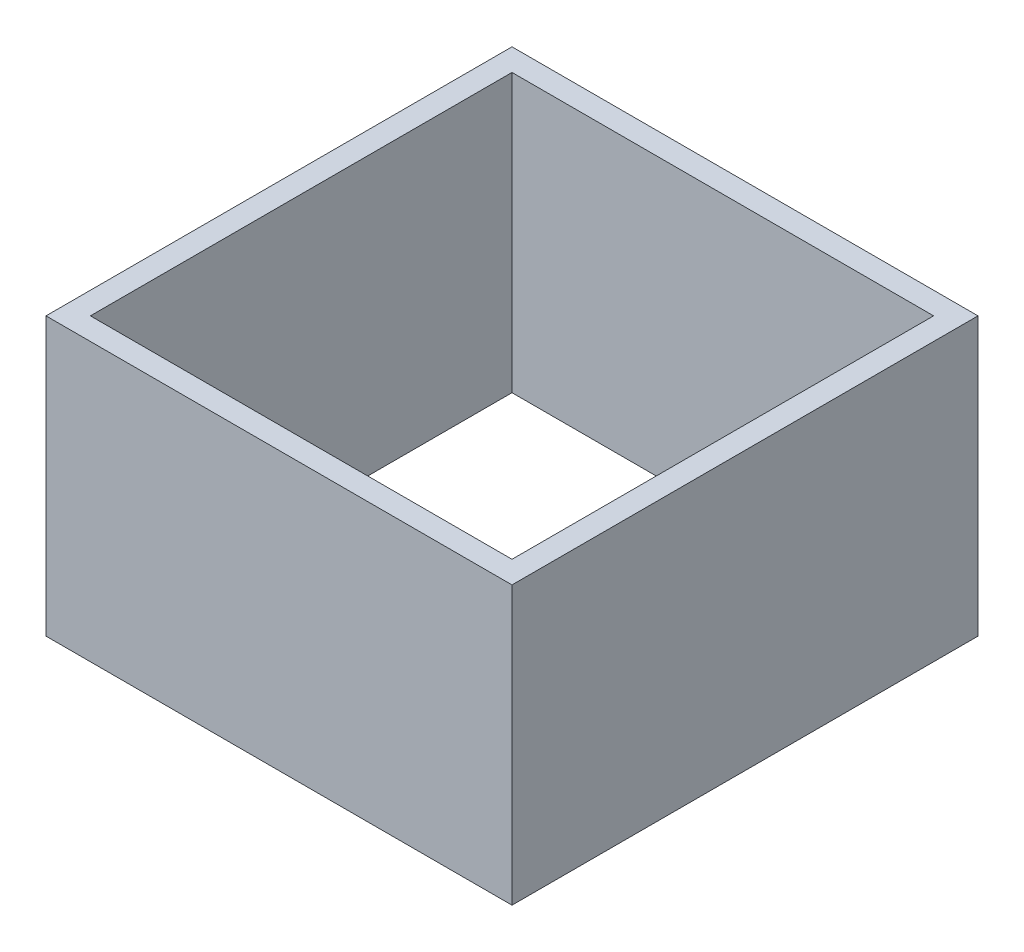
ISO-10303-21;
HEADER;
FILE_DESCRIPTION(('STEP AP214'),'2;1');
FILE_NAME('part.step','',(''),(''),'','','');
FILE_SCHEMA(('AUTOMOTIVE_DESIGN { 1 0 10303 214 1 1 1 1 }'));
ENDSEC;
DATA;
#1=APPLICATION_CONTEXT('core data for automotive mechanical design processes');
#2=APPLICATION_PROTOCOL_DEFINITION('international standard','automotive_design',2000,#1);
#3=PRODUCT_CONTEXT('',#1,'mechanical');
#4=PRODUCT('Part','Part','',(#3));
#5=PRODUCT_RELATED_PRODUCT_CATEGORY('part','',(#4));
#6=PRODUCT_DEFINITION_FORMATION('','',#4);
#7=PRODUCT_DEFINITION_CONTEXT('part definition',#1,'design');
#8=PRODUCT_DEFINITION('design','',#6,#7);
#9=PRODUCT_DEFINITION_SHAPE('','',#8);
#10=(LENGTH_UNIT() NAMED_UNIT(*) SI_UNIT(.MILLI.,.METRE.));
#11=(NAMED_UNIT(*) PLANE_ANGLE_UNIT() SI_UNIT($,.RADIAN.));
#12=(NAMED_UNIT(*) SI_UNIT($,.STERADIAN.) SOLID_ANGLE_UNIT());
#13=UNCERTAINTY_MEASURE_WITH_UNIT(LENGTH_MEASURE(1.E-05),#10,'distance_accuracy_value','');
#14=(GEOMETRIC_REPRESENTATION_CONTEXT(3) GLOBAL_UNCERTAINTY_ASSIGNED_CONTEXT((#13)) GLOBAL_UNIT_ASSIGNED_CONTEXT((#10,
#11,#12)) REPRESENTATION_CONTEXT('',''));
#15=CARTESIAN_POINT('',(0.,0.,0.));
#16=DIRECTION('',(0.,0.,1.));
#17=DIRECTION('',(1.,0.,0.));
#18=AXIS2_PLACEMENT_3D('',#15,#16,#17);
#19=CARTESIAN_POINT('',(0.,25.,0.));
#20=DIRECTION('',(0.,-1.,0.));
#21=DIRECTION('',(0.,0.,-1.));
#22=AXIS2_PLACEMENT_3D('',#19,#20,#21);
#23=PLANE('',#22);
#24=DIRECTION('',(1.,0.,0.));
#25=VECTOR('',#24,1.);
#26=CARTESIAN_POINT('',(21.,25.,21.));
#27=LINE('',#26,#25);
#28=CARTESIAN_POINT('',(-21.,25.,21.));
#29=VERTEX_POINT('',#28);
#30=CARTESIAN_POINT('',(21.,25.,21.));
#31=VERTEX_POINT('',#30);
#32=EDGE_CURVE('E134',#29,#31,#27,.T.);
#33=ORIENTED_EDGE('',*,*,#32,.T.);
#34=DIRECTION('',(0.,0.,-1.));
#35=VECTOR('',#34,1.);
#36=CARTESIAN_POINT('',(21.,25.,21.));
#37=LINE('',#36,#35);
#38=CARTESIAN_POINT('',(21.,25.,-21.));
#39=VERTEX_POINT('',#38);
#40=EDGE_CURVE('E137',#31,#39,#37,.T.);
#41=ORIENTED_EDGE('',*,*,#40,.T.);
#42=DIRECTION('',(-1.,0.,0.));
#43=VECTOR('',#42,1.);
#44=CARTESIAN_POINT('',(21.,25.,-21.));
#45=LINE('',#44,#43);
#46=CARTESIAN_POINT('',(-21.,25.,-21.));
#47=VERTEX_POINT('',#46);
#48=EDGE_CURVE('E140',#39,#47,#45,.T.);
#49=ORIENTED_EDGE('',*,*,#48,.T.);
#50=DIRECTION('',(0.,0.,1.));
#51=VECTOR('',#50,1.);
#52=CARTESIAN_POINT('',(-21.,25.,21.));
#53=LINE('',#52,#51);
#54=EDGE_CURVE('E142',#47,#29,#53,.T.);
#55=ORIENTED_EDGE('',*,*,#54,.T.);
#56=EDGE_LOOP('',(#33,#41,#49,#55));
#57=FACE_BOUND('',#56,.T.);
#58=DIRECTION('',(0.,0.,1.));
#59=VECTOR('',#58,1.);
#60=CARTESIAN_POINT('',(-19.,25.,19.));
#61=LINE('',#60,#59);
#62=CARTESIAN_POINT('',(-19.,25.,-19.));
#63=VERTEX_POINT('',#62);
#64=CARTESIAN_POINT('',(-19.,25.,19.));
#65=VERTEX_POINT('',#64);
#66=EDGE_CURVE('E98',#63,#65,#61,.T.);
#67=ORIENTED_EDGE('',*,*,#66,.F.);
#68=DIRECTION('',(-1.,0.,0.));
#69=VECTOR('',#68,1.);
#70=CARTESIAN_POINT('',(19.,25.,-19.));
#71=LINE('',#70,#69);
#72=CARTESIAN_POINT('',(19.,25.,-19.));
#73=VERTEX_POINT('',#72);
#74=EDGE_CURVE('E120',#73,#63,#71,.T.);
#75=ORIENTED_EDGE('',*,*,#74,.F.);
#76=DIRECTION('',(0.,0.,-1.));
#77=VECTOR('',#76,1.);
#78=CARTESIAN_POINT('',(19.,25.,19.));
#79=LINE('',#78,#77);
#80=CARTESIAN_POINT('',(19.,25.,19.));
#81=VERTEX_POINT('',#80);
#82=EDGE_CURVE('E118',#81,#73,#79,.T.);
#83=ORIENTED_EDGE('',*,*,#82,.F.);
#84=DIRECTION('',(1.,0.,0.));
#85=VECTOR('',#84,1.);
#86=CARTESIAN_POINT('',(19.,25.,19.));
#87=LINE('',#86,#85);
#88=EDGE_CURVE('E106',#65,#81,#87,.T.);
#89=ORIENTED_EDGE('',*,*,#88,.F.);
#90=EDGE_LOOP('',(#67,#75,#83,#89));
#91=FACE_BOUND('',#90,.T.);
#92=ADVANCED_FACE('F33',(#57,#91),#23,.F.);
#93=CARTESIAN_POINT('',(0.,0.,0.));
#94=DIRECTION('',(0.,-1.,0.));
#95=DIRECTION('',(0.,0.,-1.));
#96=AXIS2_PLACEMENT_3D('',#93,#94,#95);
#97=PLANE('',#96);
#98=DIRECTION('',(1.,0.,0.));
#99=VECTOR('',#98,1.);
#100=CARTESIAN_POINT('',(21.,0.,21.));
#101=LINE('',#100,#99);
#102=CARTESIAN_POINT('',(-21.,0.,21.));
#103=VERTEX_POINT('',#102);
#104=CARTESIAN_POINT('',(21.,0.,21.));
#105=VERTEX_POINT('',#104);
#106=EDGE_CURVE('E114',#103,#105,#101,.T.);
#107=ORIENTED_EDGE('',*,*,#106,.F.);
#108=DIRECTION('',(0.,0.,1.));
#109=VECTOR('',#108,1.);
#110=CARTESIAN_POINT('',(-21.,0.,21.));
#111=LINE('',#110,#109);
#112=CARTESIAN_POINT('',(-21.,0.,-21.));
#113=VERTEX_POINT('',#112);
#114=EDGE_CURVE('E138',#113,#103,#111,.T.);
#115=ORIENTED_EDGE('',*,*,#114,.F.);
#116=DIRECTION('',(-1.,0.,0.));
#117=VECTOR('',#116,1.);
#118=CARTESIAN_POINT('',(21.,0.,-21.));
#119=LINE('',#118,#117);
#120=CARTESIAN_POINT('',(21.,0.,-21.));
#121=VERTEX_POINT('',#120);
#122=EDGE_CURVE('E149',#121,#113,#119,.T.);
#123=ORIENTED_EDGE('',*,*,#122,.F.);
#124=DIRECTION('',(0.,0.,-1.));
#125=VECTOR('',#124,1.);
#126=CARTESIAN_POINT('',(21.,0.,21.));
#127=LINE('',#126,#125);
#128=EDGE_CURVE('E147',#105,#121,#127,.T.);
#129=ORIENTED_EDGE('',*,*,#128,.F.);
#130=EDGE_LOOP('',(#107,#115,#123,#129));
#131=FACE_BOUND('',#130,.T.);
#132=DIRECTION('',(-1.,0.,0.));
#133=VECTOR('',#132,1.);
#134=CARTESIAN_POINT('',(19.,0.,-19.));
#135=LINE('',#134,#133);
#136=CARTESIAN_POINT('',(19.,0.,-19.));
#137=VERTEX_POINT('',#136);
#138=CARTESIAN_POINT('',(-19.,0.,-19.));
#139=VERTEX_POINT('',#138);
#140=EDGE_CURVE('E107',#137,#139,#135,.T.);
#141=ORIENTED_EDGE('',*,*,#140,.T.);
#142=DIRECTION('',(0.,0.,1.));
#143=VECTOR('',#142,1.);
#144=CARTESIAN_POINT('',(-19.,0.,19.));
#145=LINE('',#144,#143);
#146=CARTESIAN_POINT('',(-19.,0.,19.));
#147=VERTEX_POINT('',#146);
#148=EDGE_CURVE('E56',#139,#147,#145,.T.);
#149=ORIENTED_EDGE('',*,*,#148,.T.);
#150=DIRECTION('',(1.,0.,0.));
#151=VECTOR('',#150,1.);
#152=CARTESIAN_POINT('',(19.,0.,19.));
#153=LINE('',#152,#151);
#154=CARTESIAN_POINT('',(19.,0.,19.));
#155=VERTEX_POINT('',#154);
#156=EDGE_CURVE('E113',#147,#155,#153,.T.);
#157=ORIENTED_EDGE('',*,*,#156,.T.);
#158=DIRECTION('',(0.,0.,-1.));
#159=VECTOR('',#158,1.);
#160=CARTESIAN_POINT('',(19.,0.,19.));
#161=LINE('',#160,#159);
#162=EDGE_CURVE('E126',#155,#137,#161,.T.);
#163=ORIENTED_EDGE('',*,*,#162,.T.);
#164=EDGE_LOOP('',(#141,#149,#157,#163));
#165=FACE_BOUND('',#164,.T.);
#166=ADVANCED_FACE('F167',(#131,#165),#97,.T.);
#167=CARTESIAN_POINT('',(21.,25.,21.));
#168=DIRECTION('',(0.,0.,-1.));
#169=DIRECTION('',(-1.,0.,0.));
#170=AXIS2_PLACEMENT_3D('',#167,#168,#169);
#171=PLANE('',#170);
#172=ORIENTED_EDGE('',*,*,#106,.T.);
#173=DIRECTION('',(0.,-1.,0.));
#174=VECTOR('',#173,1.);
#175=CARTESIAN_POINT('',(21.,25.,21.));
#176=LINE('',#175,#174);
#177=EDGE_CURVE('E11',#31,#105,#176,.T.);
#178=ORIENTED_EDGE('',*,*,#177,.F.);
#179=ORIENTED_EDGE('',*,*,#32,.F.);
#180=DIRECTION('',(0.,-1.,0.));
#181=VECTOR('',#180,1.);
#182=CARTESIAN_POINT('',(-21.,25.,21.));
#183=LINE('',#182,#181);
#184=EDGE_CURVE('E144',#29,#103,#183,.T.);
#185=ORIENTED_EDGE('',*,*,#184,.T.);
#186=EDGE_LOOP('',(#172,#178,#179,#185));
#187=FACE_BOUND('',#186,.T.);
#188=ADVANCED_FACE('F35',(#187),#171,.F.);
#189=CARTESIAN_POINT('',(21.,25.,21.));
#190=DIRECTION('',(-1.,0.,0.));
#191=DIRECTION('',(0.,0.,1.));
#192=AXIS2_PLACEMENT_3D('',#189,#190,#191);
#193=PLANE('',#192);
#194=ORIENTED_EDGE('',*,*,#128,.T.);
#195=DIRECTION('',(0.,-1.,0.));
#196=VECTOR('',#195,1.);
#197=CARTESIAN_POINT('',(21.,25.,-21.));
#198=LINE('',#197,#196);
#199=EDGE_CURVE('E41',#39,#121,#198,.T.);
#200=ORIENTED_EDGE('',*,*,#199,.F.);
#201=ORIENTED_EDGE('',*,*,#40,.F.);
#202=ORIENTED_EDGE('',*,*,#177,.T.);
#203=EDGE_LOOP('',(#194,#200,#201,#202));
#204=FACE_BOUND('',#203,.T.);
#205=ADVANCED_FACE('F177',(#204),#193,.F.);
#206=CARTESIAN_POINT('',(21.,25.,-21.));
#207=DIRECTION('',(0.,0.,1.));
#208=DIRECTION('',(1.,0.,0.));
#209=AXIS2_PLACEMENT_3D('',#206,#207,#208);
#210=PLANE('',#209);
#211=ORIENTED_EDGE('',*,*,#122,.T.);
#212=DIRECTION('',(0.,-1.,0.));
#213=VECTOR('',#212,1.);
#214=CARTESIAN_POINT('',(-21.,25.,-21.));
#215=LINE('',#214,#213);
#216=EDGE_CURVE('E154',#47,#113,#215,.T.);
#217=ORIENTED_EDGE('',*,*,#216,.F.);
#218=ORIENTED_EDGE('',*,*,#48,.F.);
#219=ORIENTED_EDGE('',*,*,#199,.T.);
#220=EDGE_LOOP('',(#211,#217,#218,#219));
#221=FACE_BOUND('',#220,.T.);
#222=ADVANCED_FACE('F161',(#221),#210,.F.);
#223=CARTESIAN_POINT('',(-21.,25.,21.));
#224=DIRECTION('',(1.,0.,0.));
#225=DIRECTION('',(0.,0.,-1.));
#226=AXIS2_PLACEMENT_3D('',#223,#224,#225);
#227=PLANE('',#226);
#228=ORIENTED_EDGE('',*,*,#114,.T.);
#229=ORIENTED_EDGE('',*,*,#184,.F.);
#230=ORIENTED_EDGE('',*,*,#54,.F.);
#231=ORIENTED_EDGE('',*,*,#216,.T.);
#232=EDGE_LOOP('',(#228,#229,#230,#231));
#233=FACE_BOUND('',#232,.T.);
#234=ADVANCED_FACE('F171',(#233),#227,.F.);
#235=CARTESIAN_POINT('',(-19.,25.,19.));
#236=DIRECTION('',(1.,0.,0.));
#237=DIRECTION('',(0.,0.,-1.));
#238=AXIS2_PLACEMENT_3D('',#235,#236,#237);
#239=PLANE('',#238);
#240=ORIENTED_EDGE('',*,*,#148,.F.);
#241=DIRECTION('',(0.,-1.,0.));
#242=VECTOR('',#241,1.);
#243=CARTESIAN_POINT('',(-19.,25.,-19.));
#244=LINE('',#243,#242);
#245=EDGE_CURVE('E102',#63,#139,#244,.T.);
#246=ORIENTED_EDGE('',*,*,#245,.F.);
#247=ORIENTED_EDGE('',*,*,#66,.T.);
#248=DIRECTION('',(0.,-1.,0.));
#249=VECTOR('',#248,1.);
#250=CARTESIAN_POINT('',(-19.,25.,19.));
#251=LINE('',#250,#249);
#252=EDGE_CURVE('E101',#65,#147,#251,.T.);
#253=ORIENTED_EDGE('',*,*,#252,.T.);
#254=EDGE_LOOP('',(#240,#246,#247,#253));
#255=FACE_BOUND('',#254,.T.);
#256=ADVANCED_FACE('F100',(#255),#239,.T.);
#257=CARTESIAN_POINT('',(19.,25.,19.));
#258=DIRECTION('',(0.,0.,-1.));
#259=DIRECTION('',(-1.,0.,0.));
#260=AXIS2_PLACEMENT_3D('',#257,#258,#259);
#261=PLANE('',#260);
#262=ORIENTED_EDGE('',*,*,#156,.F.);
#263=ORIENTED_EDGE('',*,*,#252,.F.);
#264=ORIENTED_EDGE('',*,*,#88,.T.);
#265=DIRECTION('',(0.,-1.,0.));
#266=VECTOR('',#265,1.);
#267=CARTESIAN_POINT('',(19.,25.,19.));
#268=LINE('',#267,#266);
#269=EDGE_CURVE('E115',#81,#155,#268,.T.);
#270=ORIENTED_EDGE('',*,*,#269,.T.);
#271=EDGE_LOOP('',(#262,#263,#264,#270));
#272=FACE_BOUND('',#271,.T.);
#273=ADVANCED_FACE('F110',(#272),#261,.T.);
#274=CARTESIAN_POINT('',(19.,25.,19.));
#275=DIRECTION('',(-1.,0.,0.));
#276=DIRECTION('',(0.,0.,1.));
#277=AXIS2_PLACEMENT_3D('',#274,#275,#276);
#278=PLANE('',#277);
#279=ORIENTED_EDGE('',*,*,#162,.F.);
#280=ORIENTED_EDGE('',*,*,#269,.F.);
#281=ORIENTED_EDGE('',*,*,#82,.T.);
#282=DIRECTION('',(0.,-1.,0.));
#283=VECTOR('',#282,1.);
#284=CARTESIAN_POINT('',(19.,25.,-19.));
#285=LINE('',#284,#283);
#286=EDGE_CURVE('E48',#73,#137,#285,.T.);
#287=ORIENTED_EDGE('',*,*,#286,.T.);
#288=EDGE_LOOP('',(#279,#280,#281,#287));
#289=FACE_BOUND('',#288,.T.);
#290=ADVANCED_FACE('F200',(#289),#278,.T.);
#291=CARTESIAN_POINT('',(19.,25.,-19.));
#292=DIRECTION('',(0.,0.,1.));
#293=DIRECTION('',(1.,0.,0.));
#294=AXIS2_PLACEMENT_3D('',#291,#292,#293);
#295=PLANE('',#294);
#296=ORIENTED_EDGE('',*,*,#140,.F.);
#297=ORIENTED_EDGE('',*,*,#286,.F.);
#298=ORIENTED_EDGE('',*,*,#74,.T.);
#299=ORIENTED_EDGE('',*,*,#245,.T.);
#300=EDGE_LOOP('',(#296,#297,#298,#299));
#301=FACE_BOUND('',#300,.T.);
#302=ADVANCED_FACE('F204',(#301),#295,.T.);
#303=CLOSED_SHELL('',(#92,#166,#188,#205,#222,#234,#256,#273,#290,#302));
#304=MANIFOLD_SOLID_BREP('B2',#303);
#305=ADVANCED_BREP_SHAPE_REPRESENTATION('',(#18,#304),#14);
#306=SHAPE_DEFINITION_REPRESENTATION(#9,#305);
ENDSEC;
END-ISO-10303-21;
